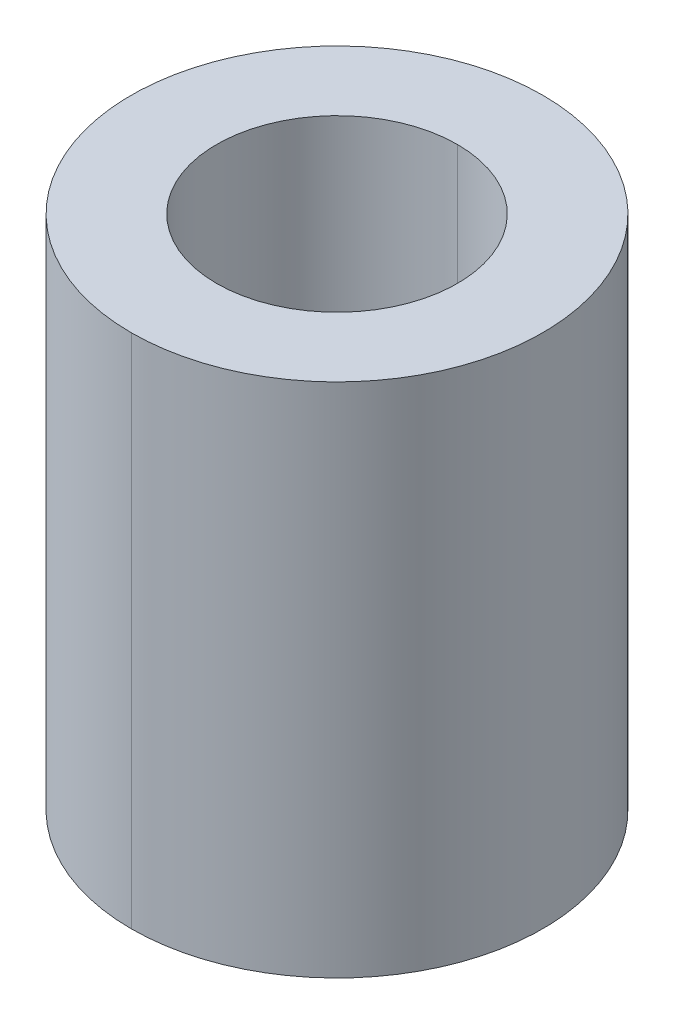
ISO-10303-21;
HEADER;
FILE_DESCRIPTION(('STEP AP214'),'2;1');
FILE_NAME('part.step','',(''),(''),'','','');
FILE_SCHEMA(('AUTOMOTIVE_DESIGN { 1 0 10303 214 1 1 1 1 }'));
ENDSEC;
DATA;
#1=APPLICATION_CONTEXT('core data for automotive mechanical design processes');
#2=APPLICATION_PROTOCOL_DEFINITION('international standard','automotive_design',2000,#1);
#3=PRODUCT_CONTEXT('',#1,'mechanical');
#4=PRODUCT('Part','Part','',(#3));
#5=PRODUCT_RELATED_PRODUCT_CATEGORY('part','',(#4));
#6=PRODUCT_DEFINITION_FORMATION('','',#4);
#7=PRODUCT_DEFINITION_CONTEXT('part definition',#1,'design');
#8=PRODUCT_DEFINITION('design','',#6,#7);
#9=PRODUCT_DEFINITION_SHAPE('','',#8);
#10=(LENGTH_UNIT() NAMED_UNIT(*) SI_UNIT(.MILLI.,.METRE.));
#11=(NAMED_UNIT(*) PLANE_ANGLE_UNIT() SI_UNIT($,.RADIAN.));
#12=(NAMED_UNIT(*) SI_UNIT($,.STERADIAN.) SOLID_ANGLE_UNIT());
#13=UNCERTAINTY_MEASURE_WITH_UNIT(LENGTH_MEASURE(1.E-05),#10,'distance_accuracy_value','');
#14=(GEOMETRIC_REPRESENTATION_CONTEXT(3) GLOBAL_UNCERTAINTY_ASSIGNED_CONTEXT((#13)) GLOBAL_UNIT_ASSIGNED_CONTEXT((#10,
#11,#12)) REPRESENTATION_CONTEXT('',''));
#15=CARTESIAN_POINT('',(0.,0.,0.));
#16=DIRECTION('',(0.,0.,1.));
#17=DIRECTION('',(1.,0.,0.));
#18=AXIS2_PLACEMENT_3D('',#15,#16,#17);
#19=CARTESIAN_POINT('',(-4.44089209850063E-13,47.8,0.));
#20=DIRECTION('',(0.,-1.,0.));
#21=DIRECTION('',(0.,0.,-1.));
#22=AXIS2_PLACEMENT_3D('',#19,#20,#21);
#23=CYLINDRICAL_SURFACE('',#22,11.15);
#24=DIRECTION('',(0.,-1.,0.));
#25=VECTOR('',#24,1.);
#26=CARTESIAN_POINT('',(-4.49532171367527E-13,47.8,11.15));
#27=LINE('',#26,#25);
#28=CARTESIAN_POINT('',(-4.28281778210285E-13,47.8,11.15));
#29=VERTEX_POINT('',#28);
#30=CARTESIAN_POINT('',(-4.28281778210285E-13,0.,11.15));
#31=VERTEX_POINT('',#30);
#32=EDGE_CURVE('E84',#29,#31,#27,.T.);
#33=ORIENTED_EDGE('',*,*,#32,.F.);
#34=CARTESIAN_POINT('',(-4.44089209850063E-13,47.8,0.));
#35=DIRECTION('',(0.,1.,0.));
#36=DIRECTION('',(0.,0.,1.));
#37=AXIS2_PLACEMENT_3D('',#34,#35,#36);
#38=CIRCLE('',#37,11.15);
#39=CARTESIAN_POINT('',(-4.16030373994307E-13,47.8,-11.15));
#40=VERTEX_POINT('',#39);
#41=EDGE_CURVE('E77',#29,#40,#38,.T.);
#42=ORIENTED_EDGE('',*,*,#41,.T.);
#43=DIRECTION('',(0.,-1.,0.));
#44=VECTOR('',#43,1.);
#45=CARTESIAN_POINT('',(-4.37280767151549E-13,47.8,-11.15));
#46=LINE('',#45,#44);
#47=CARTESIAN_POINT('',(-4.16030373994309E-13,0.,-11.15));
#48=VERTEX_POINT('',#47);
#49=EDGE_CURVE('E75',#40,#48,#46,.T.);
#50=ORIENTED_EDGE('',*,*,#49,.T.);
#51=CARTESIAN_POINT('',(0.,0.,0.));
#52=DIRECTION('',(0.,1.,0.));
#53=DIRECTION('',(0.,0.,1.));
#54=AXIS2_PLACEMENT_3D('',#51,#52,#53);
#55=CIRCLE('',#54,11.15);
#56=EDGE_CURVE('E11',#31,#48,#55,.T.);
#57=ORIENTED_EDGE('',*,*,#56,.F.);
#58=EDGE_LOOP('',(#33,#42,#50,#57));
#59=FACE_BOUND('',#58,.T.);
#60=ADVANCED_FACE('F17',(#59),#23,.F.);
#61=CARTESIAN_POINT('',(-4.44089209850063E-13,47.8,0.));
#62=DIRECTION('',(0.,-1.,0.));
#63=DIRECTION('',(0.,0.,-1.));
#64=AXIS2_PLACEMENT_3D('',#61,#62,#63);
#65=CYLINDRICAL_SURFACE('',#64,19.05);
#66=DIRECTION('',(0.,-1.,0.));
#67=VECTOR('',#66,1.);
#68=CARTESIAN_POINT('',(-4.53388619438197E-13,47.8,19.05));
#69=LINE('',#68,#67);
#70=CARTESIAN_POINT('',(-4.32138226280955E-13,47.8,19.05));
#71=VERTEX_POINT('',#70);
#72=CARTESIAN_POINT('',(-4.32138226280955E-13,0.,19.05));
#73=VERTEX_POINT('',#72);
#74=EDGE_CURVE('E21',#71,#73,#69,.T.);
#75=ORIENTED_EDGE('',*,*,#74,.F.);
#76=CARTESIAN_POINT('',(-4.44089209850063E-13,47.8,0.));
#77=DIRECTION('',(0.,1.,0.));
#78=DIRECTION('',(0.,0.,1.));
#79=AXIS2_PLACEMENT_3D('',#76,#77,#78);
#80=CIRCLE('',#79,19.05);
#81=CARTESIAN_POINT('',(-4.11206454952311E-13,47.8,-19.05));
#82=VERTEX_POINT('',#81);
#83=EDGE_CURVE('E97',#82,#71,#80,.T.);
#84=ORIENTED_EDGE('',*,*,#83,.F.);
#85=DIRECTION('',(0.,-1.,0.));
#86=VECTOR('',#85,1.);
#87=CARTESIAN_POINT('',(-4.32456848109553E-13,47.8,-19.05));
#88=LINE('',#87,#86);
#89=CARTESIAN_POINT('',(-4.11206454952311E-13,0.,-19.05));
#90=VERTEX_POINT('',#89);
#91=EDGE_CURVE('E98',#82,#90,#88,.T.);
#92=ORIENTED_EDGE('',*,*,#91,.T.);
#93=CARTESIAN_POINT('',(0.,0.,0.));
#94=DIRECTION('',(0.,1.,0.));
#95=DIRECTION('',(0.,0.,1.));
#96=AXIS2_PLACEMENT_3D('',#93,#94,#95);
#97=CIRCLE('',#96,19.05);
#98=EDGE_CURVE('E28',#90,#73,#97,.T.);
#99=ORIENTED_EDGE('',*,*,#98,.T.);
#100=EDGE_LOOP('',(#75,#84,#92,#99));
#101=FACE_BOUND('',#100,.T.);
#102=ADVANCED_FACE('F147',(#101),#65,.T.);
#103=CARTESIAN_POINT('',(0.,0.,0.));
#104=DIRECTION('',(0.,1.,0.));
#105=DIRECTION('',(0.,0.,-1.));
#106=AXIS2_PLACEMENT_3D('',#103,#104,#105);
#107=PLANE('',#106);
#108=CARTESIAN_POINT('',(0.,0.,0.));
#109=DIRECTION('',(0.,1.,0.));
#110=DIRECTION('',(0.,0.,1.));
#111=AXIS2_PLACEMENT_3D('',#108,#109,#110);
#112=CIRCLE('',#111,11.15);
#113=EDGE_CURVE('E70',#48,#31,#112,.T.);
#114=ORIENTED_EDGE('',*,*,#113,.T.);
#115=ORIENTED_EDGE('',*,*,#56,.T.);
#116=EDGE_LOOP('',(#114,#115));
#117=FACE_BOUND('',#116,.T.);
#118=ORIENTED_EDGE('',*,*,#98,.F.);
#119=CARTESIAN_POINT('',(0.,0.,0.));
#120=DIRECTION('',(0.,1.,0.));
#121=DIRECTION('',(0.,0.,1.));
#122=AXIS2_PLACEMENT_3D('',#119,#120,#121);
#123=CIRCLE('',#122,19.05);
#124=EDGE_CURVE('E99',#73,#90,#123,.T.);
#125=ORIENTED_EDGE('',*,*,#124,.F.);
#126=EDGE_LOOP('',(#118,#125));
#127=FACE_BOUND('',#126,.T.);
#128=ADVANCED_FACE('F68',(#117,#127),#107,.F.);
#129=CARTESIAN_POINT('',(-4.44089209850063E-13,47.8,0.));
#130=DIRECTION('',(0.,1.,0.));
#131=DIRECTION('',(0.,0.,-1.));
#132=AXIS2_PLACEMENT_3D('',#129,#130,#131);
#133=PLANE('',#132);
#134=CARTESIAN_POINT('',(-4.44089209850063E-13,47.8,0.));
#135=DIRECTION('',(0.,1.,0.));
#136=DIRECTION('',(0.,0.,1.));
#137=AXIS2_PLACEMENT_3D('',#134,#135,#136);
#138=CIRCLE('',#137,11.15);
#139=EDGE_CURVE('E92',#40,#29,#138,.T.);
#140=ORIENTED_EDGE('',*,*,#139,.F.);
#141=ORIENTED_EDGE('',*,*,#41,.F.);
#142=EDGE_LOOP('',(#140,#141));
#143=FACE_BOUND('',#142,.T.);
#144=ORIENTED_EDGE('',*,*,#83,.T.);
#145=CARTESIAN_POINT('',(-4.44089209850063E-13,47.8,0.));
#146=DIRECTION('',(0.,1.,0.));
#147=DIRECTION('',(0.,0.,1.));
#148=AXIS2_PLACEMENT_3D('',#145,#146,#147);
#149=CIRCLE('',#148,19.05);
#150=EDGE_CURVE('E82',#71,#82,#149,.T.);
#151=ORIENTED_EDGE('',*,*,#150,.T.);
#152=EDGE_LOOP('',(#144,#151));
#153=FACE_BOUND('',#152,.T.);
#154=ADVANCED_FACE('F163',(#143,#153),#133,.T.);
#155=CARTESIAN_POINT('',(-4.44089209850063E-13,47.8,0.));
#156=DIRECTION('',(0.,-1.,0.));
#157=DIRECTION('',(0.,0.,-1.));
#158=AXIS2_PLACEMENT_3D('',#155,#156,#157);
#159=CYLINDRICAL_SURFACE('',#158,19.05);
#160=ORIENTED_EDGE('',*,*,#150,.F.);
#161=ORIENTED_EDGE('',*,*,#74,.T.);
#162=ORIENTED_EDGE('',*,*,#124,.T.);
#163=ORIENTED_EDGE('',*,*,#91,.F.);
#164=EDGE_LOOP('',(#160,#161,#162,#163));
#165=FACE_BOUND('',#164,.T.);
#166=ADVANCED_FACE('F167',(#165),#159,.T.);
#167=CARTESIAN_POINT('',(-4.44089209850063E-13,47.8,0.));
#168=DIRECTION('',(0.,-1.,0.));
#169=DIRECTION('',(0.,0.,-1.));
#170=AXIS2_PLACEMENT_3D('',#167,#168,#169);
#171=CYLINDRICAL_SURFACE('',#170,11.15);
#172=ORIENTED_EDGE('',*,*,#139,.T.);
#173=ORIENTED_EDGE('',*,*,#32,.T.);
#174=ORIENTED_EDGE('',*,*,#113,.F.);
#175=ORIENTED_EDGE('',*,*,#49,.F.);
#176=EDGE_LOOP('',(#172,#173,#174,#175));
#177=FACE_BOUND('',#176,.T.);
#178=ADVANCED_FACE('F19',(#177),#171,.F.);
#179=CLOSED_SHELL('',(#60,#102,#128,#154,#166,#178));
#180=MANIFOLD_SOLID_BREP('B1',#179);
#181=ADVANCED_BREP_SHAPE_REPRESENTATION('',(#18,#180),#14);
#182=SHAPE_DEFINITION_REPRESENTATION(#9,#181);
ENDSEC;
END-ISO-10303-21;
